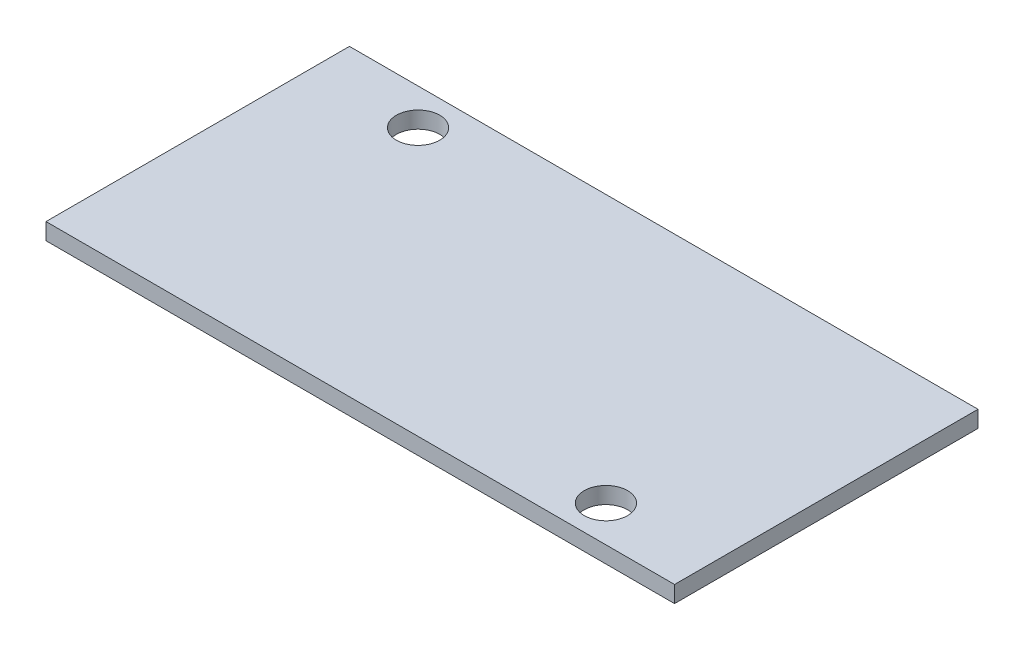
ISO-10303-21;
HEADER;
FILE_DESCRIPTION(('STEP AP214'),'2;1');
FILE_NAME('part.step','',(''),(''),'','','');
FILE_SCHEMA(('AUTOMOTIVE_DESIGN { 1 0 10303 214 1 1 1 1 }'));
ENDSEC;
DATA;
#1=APPLICATION_CONTEXT('core data for automotive mechanical design processes');
#2=APPLICATION_PROTOCOL_DEFINITION('international standard','automotive_design',2000,#1);
#3=PRODUCT_CONTEXT('',#1,'mechanical');
#4=PRODUCT('Part','Part','',(#3));
#5=PRODUCT_RELATED_PRODUCT_CATEGORY('part','',(#4));
#6=PRODUCT_DEFINITION_FORMATION('','',#4);
#7=PRODUCT_DEFINITION_CONTEXT('part definition',#1,'design');
#8=PRODUCT_DEFINITION('design','',#6,#7);
#9=PRODUCT_DEFINITION_SHAPE('','',#8);
#10=(LENGTH_UNIT() NAMED_UNIT(*) SI_UNIT(.MILLI.,.METRE.));
#11=(NAMED_UNIT(*) PLANE_ANGLE_UNIT() SI_UNIT($,.RADIAN.));
#12=(NAMED_UNIT(*) SI_UNIT($,.STERADIAN.) SOLID_ANGLE_UNIT());
#13=UNCERTAINTY_MEASURE_WITH_UNIT(LENGTH_MEASURE(1.E-05),#10,'distance_accuracy_value','');
#14=(GEOMETRIC_REPRESENTATION_CONTEXT(3) GLOBAL_UNCERTAINTY_ASSIGNED_CONTEXT((#13)) GLOBAL_UNIT_ASSIGNED_CONTEXT((#10,
#11,#12)) REPRESENTATION_CONTEXT('',''));
#15=CARTESIAN_POINT('',(0.,0.,0.));
#16=DIRECTION('',(0.,0.,1.));
#17=DIRECTION('',(1.,0.,0.));
#18=AXIS2_PLACEMENT_3D('',#15,#16,#17);
#19=CARTESIAN_POINT('',(0.,1.15,0.));
#20=DIRECTION('',(0.,-1.,0.));
#21=DIRECTION('',(0.,0.,-1.));
#22=AXIS2_PLACEMENT_3D('',#19,#20,#21);
#23=PLANE('',#22);
#24=DIRECTION('',(0.,0.,-1.));
#25=VECTOR('',#24,1.);
#26=CARTESIAN_POINT('',(21.75,1.15,10.5));
#27=LINE('',#26,#25);
#28=CARTESIAN_POINT('',(21.75,1.15,10.5));
#29=VERTEX_POINT('',#28);
#30=CARTESIAN_POINT('',(21.75,1.15,-10.5));
#31=VERTEX_POINT('',#30);
#32=EDGE_CURVE('E86',#29,#31,#27,.T.);
#33=ORIENTED_EDGE('',*,*,#32,.T.);
#34=DIRECTION('',(-1.,0.,0.));
#35=VECTOR('',#34,1.);
#36=CARTESIAN_POINT('',(-21.75,1.15,-10.5));
#37=LINE('',#36,#35);
#38=CARTESIAN_POINT('',(-21.75,1.15,-10.5));
#39=VERTEX_POINT('',#38);
#40=EDGE_CURVE('E81',#31,#39,#37,.T.);
#41=ORIENTED_EDGE('',*,*,#40,.T.);
#42=DIRECTION('',(0.,0.,1.));
#43=VECTOR('',#42,1.);
#44=CARTESIAN_POINT('',(-21.75,1.15,10.5));
#45=LINE('',#44,#43);
#46=CARTESIAN_POINT('',(-21.75,1.15,10.5));
#47=VERTEX_POINT('',#46);
#48=EDGE_CURVE('E84',#39,#47,#45,.T.);
#49=ORIENTED_EDGE('',*,*,#48,.T.);
#50=DIRECTION('',(1.,0.,0.));
#51=VECTOR('',#50,1.);
#52=CARTESIAN_POINT('',(-21.75,1.15,10.5));
#53=LINE('',#52,#51);
#54=EDGE_CURVE('E51',#47,#29,#53,.T.);
#55=ORIENTED_EDGE('',*,*,#54,.T.);
#56=EDGE_LOOP('',(#33,#41,#49,#55));
#57=FACE_BOUND('',#56,.T.);
#58=CARTESIAN_POINT('',(-14.5,1.15,-8.));
#59=DIRECTION('',(0.,1.,0.));
#60=DIRECTION('',(0.,0.,1.));
#61=AXIS2_PLACEMENT_3D('',#58,#59,#60);
#62=CIRCLE('',#61,1.5);
#63=CARTESIAN_POINT('',(-14.5,1.15,-6.5));
#64=VERTEX_POINT('',#63);
#65=EDGE_CURVE('E101',#64,#64,#62,.T.);
#66=ORIENTED_EDGE('',*,*,#65,.F.);
#67=EDGE_LOOP('',(#66));
#68=FACE_BOUND('',#67,.T.);
#69=CARTESIAN_POINT('',(14.5,1.15,8.));
#70=DIRECTION('',(0.,1.,0.));
#71=DIRECTION('',(0.,0.,1.));
#72=AXIS2_PLACEMENT_3D('',#69,#70,#71);
#73=CIRCLE('',#72,1.5);
#74=CARTESIAN_POINT('',(14.5,1.15,9.5));
#75=VERTEX_POINT('',#74);
#76=EDGE_CURVE('E116',#75,#75,#73,.T.);
#77=ORIENTED_EDGE('',*,*,#76,.F.);
#78=EDGE_LOOP('',(#77));
#79=FACE_BOUND('',#78,.T.);
#80=ADVANCED_FACE('F34',(#57,#68,#79),#23,.F.);
#81=CARTESIAN_POINT('',(0.,0.,0.));
#82=DIRECTION('',(0.,-1.,0.));
#83=DIRECTION('',(0.,0.,-1.));
#84=AXIS2_PLACEMENT_3D('',#81,#82,#83);
#85=PLANE('',#84);
#86=CARTESIAN_POINT('',(-14.5,0.,-8.));
#87=DIRECTION('',(0.,1.,0.));
#88=DIRECTION('',(0.,0.,1.));
#89=AXIS2_PLACEMENT_3D('',#86,#87,#88);
#90=CIRCLE('',#89,1.5);
#91=CARTESIAN_POINT('',(-14.5,0.,-6.5));
#92=VERTEX_POINT('',#91);
#93=EDGE_CURVE('E113',#92,#92,#90,.T.);
#94=ORIENTED_EDGE('',*,*,#93,.T.);
#95=EDGE_LOOP('',(#94));
#96=FACE_BOUND('',#95,.T.);
#97=DIRECTION('',(0.,0.,-1.));
#98=VECTOR('',#97,1.);
#99=CARTESIAN_POINT('',(21.75,0.,10.5));
#100=LINE('',#99,#98);
#101=CARTESIAN_POINT('',(21.75,0.,10.5));
#102=VERTEX_POINT('',#101);
#103=CARTESIAN_POINT('',(21.75,0.,-10.5));
#104=VERTEX_POINT('',#103);
#105=EDGE_CURVE('E98',#102,#104,#100,.T.);
#106=ORIENTED_EDGE('',*,*,#105,.F.);
#107=DIRECTION('',(1.,0.,0.));
#108=VECTOR('',#107,1.);
#109=CARTESIAN_POINT('',(-21.75,0.,10.5));
#110=LINE('',#109,#108);
#111=CARTESIAN_POINT('',(-21.75,0.,10.5));
#112=VERTEX_POINT('',#111);
#113=EDGE_CURVE('E74',#112,#102,#110,.T.);
#114=ORIENTED_EDGE('',*,*,#113,.F.);
#115=DIRECTION('',(0.,0.,1.));
#116=VECTOR('',#115,1.);
#117=CARTESIAN_POINT('',(-21.75,0.,10.5));
#118=LINE('',#117,#116);
#119=CARTESIAN_POINT('',(-21.75,0.,-10.5));
#120=VERTEX_POINT('',#119);
#121=EDGE_CURVE('E68',#120,#112,#118,.T.);
#122=ORIENTED_EDGE('',*,*,#121,.F.);
#123=DIRECTION('',(-1.,0.,0.));
#124=VECTOR('',#123,1.);
#125=CARTESIAN_POINT('',(-21.75,0.,-10.5));
#126=LINE('',#125,#124);
#127=EDGE_CURVE('E90',#104,#120,#126,.T.);
#128=ORIENTED_EDGE('',*,*,#127,.F.);
#129=EDGE_LOOP('',(#106,#114,#122,#128));
#130=FACE_BOUND('',#129,.T.);
#131=CARTESIAN_POINT('',(14.5,0.,8.));
#132=DIRECTION('',(0.,1.,0.));
#133=DIRECTION('',(0.,0.,1.));
#134=AXIS2_PLACEMENT_3D('',#131,#132,#133);
#135=CIRCLE('',#134,1.5);
#136=CARTESIAN_POINT('',(14.5,0.,9.5));
#137=VERTEX_POINT('',#136);
#138=EDGE_CURVE('E119',#137,#137,#135,.T.);
#139=ORIENTED_EDGE('',*,*,#138,.T.);
#140=EDGE_LOOP('',(#139));
#141=FACE_BOUND('',#140,.T.);
#142=ADVANCED_FACE('F109',(#96,#130,#141),#85,.T.);
#143=CARTESIAN_POINT('',(21.75,1.15,10.5));
#144=DIRECTION('',(-1.,0.,0.));
#145=DIRECTION('',(0.,0.,1.));
#146=AXIS2_PLACEMENT_3D('',#143,#144,#145);
#147=PLANE('',#146);
#148=ORIENTED_EDGE('',*,*,#105,.T.);
#149=DIRECTION('',(0.,-1.,0.));
#150=VECTOR('',#149,1.);
#151=CARTESIAN_POINT('',(21.75,1.15,-10.5));
#152=LINE('',#151,#150);
#153=EDGE_CURVE('E11',#31,#104,#152,.T.);
#154=ORIENTED_EDGE('',*,*,#153,.F.);
#155=ORIENTED_EDGE('',*,*,#32,.F.);
#156=DIRECTION('',(0.,-1.,0.));
#157=VECTOR('',#156,1.);
#158=CARTESIAN_POINT('',(21.75,1.15,10.5));
#159=LINE('',#158,#157);
#160=EDGE_CURVE('E94',#29,#102,#159,.T.);
#161=ORIENTED_EDGE('',*,*,#160,.T.);
#162=EDGE_LOOP('',(#148,#154,#155,#161));
#163=FACE_BOUND('',#162,.T.);
#164=ADVANCED_FACE('F36',(#163),#147,.F.);
#165=CARTESIAN_POINT('',(-21.75,1.15,-10.5));
#166=DIRECTION('',(0.,0.,1.));
#167=DIRECTION('',(1.,0.,0.));
#168=AXIS2_PLACEMENT_3D('',#165,#166,#167);
#169=PLANE('',#168);
#170=ORIENTED_EDGE('',*,*,#127,.T.);
#171=DIRECTION('',(0.,-1.,0.));
#172=VECTOR('',#171,1.);
#173=CARTESIAN_POINT('',(-21.75,1.15,-10.5));
#174=LINE('',#173,#172);
#175=EDGE_CURVE('E43',#39,#120,#174,.T.);
#176=ORIENTED_EDGE('',*,*,#175,.F.);
#177=ORIENTED_EDGE('',*,*,#40,.F.);
#178=ORIENTED_EDGE('',*,*,#153,.T.);
#179=EDGE_LOOP('',(#170,#176,#177,#178));
#180=FACE_BOUND('',#179,.T.);
#181=ADVANCED_FACE('F89',(#180),#169,.F.);
#182=CARTESIAN_POINT('',(-21.75,1.15,10.5));
#183=DIRECTION('',(1.,0.,0.));
#184=DIRECTION('',(0.,0.,-1.));
#185=AXIS2_PLACEMENT_3D('',#182,#183,#184);
#186=PLANE('',#185);
#187=ORIENTED_EDGE('',*,*,#121,.T.);
#188=DIRECTION('',(0.,-1.,0.));
#189=VECTOR('',#188,1.);
#190=CARTESIAN_POINT('',(-21.75,1.15,10.5));
#191=LINE('',#190,#189);
#192=EDGE_CURVE('E91',#47,#112,#191,.T.);
#193=ORIENTED_EDGE('',*,*,#192,.F.);
#194=ORIENTED_EDGE('',*,*,#48,.F.);
#195=ORIENTED_EDGE('',*,*,#175,.T.);
#196=EDGE_LOOP('',(#187,#193,#194,#195));
#197=FACE_BOUND('',#196,.T.);
#198=ADVANCED_FACE('F92',(#197),#186,.F.);
#199=CARTESIAN_POINT('',(-21.75,1.15,10.5));
#200=DIRECTION('',(0.,0.,-1.));
#201=DIRECTION('',(-1.,0.,0.));
#202=AXIS2_PLACEMENT_3D('',#199,#200,#201);
#203=PLANE('',#202);
#204=ORIENTED_EDGE('',*,*,#113,.T.);
#205=ORIENTED_EDGE('',*,*,#160,.F.);
#206=ORIENTED_EDGE('',*,*,#54,.F.);
#207=ORIENTED_EDGE('',*,*,#192,.T.);
#208=EDGE_LOOP('',(#204,#205,#206,#207));
#209=FACE_BOUND('',#208,.T.);
#210=ADVANCED_FACE('F106',(#209),#203,.F.);
#211=CARTESIAN_POINT('',(-14.5,1.15,-8.));
#212=DIRECTION('',(0.,-1.,0.));
#213=DIRECTION('',(0.,0.,-1.));
#214=AXIS2_PLACEMENT_3D('',#211,#212,#213);
#215=CYLINDRICAL_SURFACE('',#214,1.5);
#216=ORIENTED_EDGE('',*,*,#65,.T.);
#217=EDGE_LOOP('',(#216));
#218=FACE_BOUND('',#217,.T.);
#219=ORIENTED_EDGE('',*,*,#93,.F.);
#220=EDGE_LOOP('',(#219));
#221=FACE_BOUND('',#220,.T.);
#222=ADVANCED_FACE('F136',(#218,#221),#215,.F.);
#223=CARTESIAN_POINT('',(14.5,1.15,8.));
#224=DIRECTION('',(0.,-1.,0.));
#225=DIRECTION('',(0.,0.,-1.));
#226=AXIS2_PLACEMENT_3D('',#223,#224,#225);
#227=CYLINDRICAL_SURFACE('',#226,1.5);
#228=ORIENTED_EDGE('',*,*,#76,.T.);
#229=EDGE_LOOP('',(#228));
#230=FACE_BOUND('',#229,.T.);
#231=ORIENTED_EDGE('',*,*,#138,.F.);
#232=EDGE_LOOP('',(#231));
#233=FACE_BOUND('',#232,.T.);
#234=ADVANCED_FACE('F125',(#230,#233),#227,.F.);
#235=CLOSED_SHELL('',(#80,#142,#164,#181,#198,#210,#222,#234));
#236=MANIFOLD_SOLID_BREP('B2',#235);
#237=ADVANCED_BREP_SHAPE_REPRESENTATION('',(#18,#236),#14);
#238=SHAPE_DEFINITION_REPRESENTATION(#9,#237);
ENDSEC;
END-ISO-10303-21;
